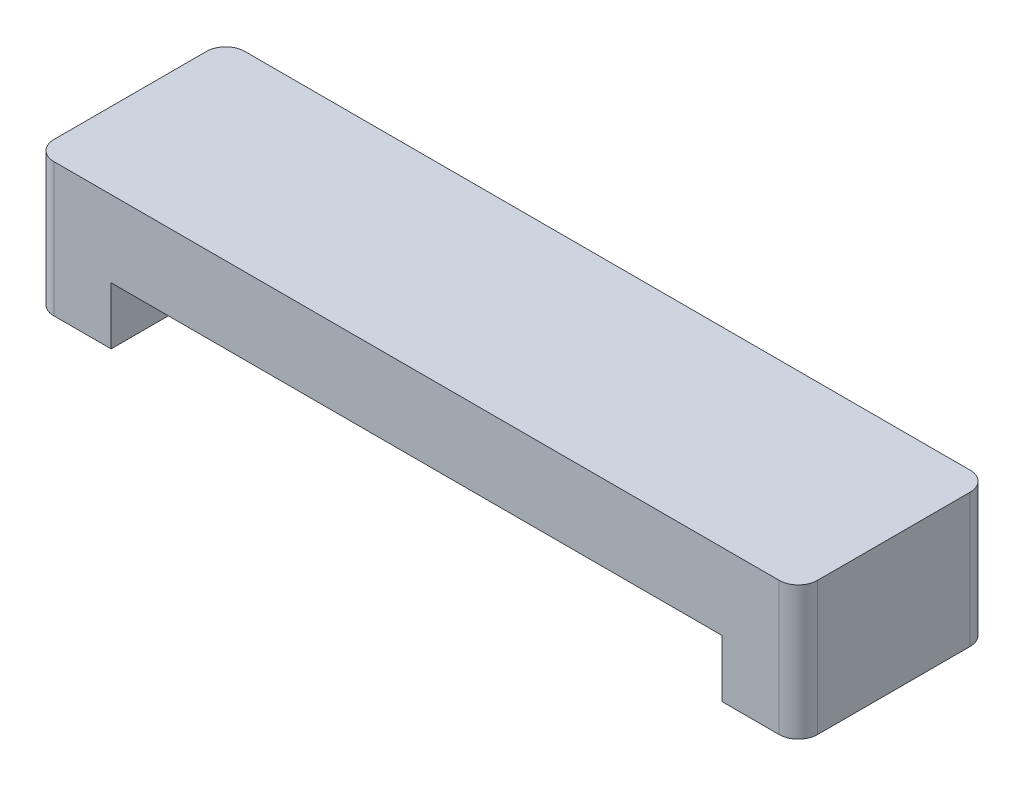
ISO-10303-21;
HEADER;
FILE_DESCRIPTION(('STEP AP214'),'2;1');
FILE_NAME('part.step','',(''),(''),'','','');
FILE_SCHEMA(('AUTOMOTIVE_DESIGN { 1 0 10303 214 1 1 1 1 }'));
ENDSEC;
DATA;
#1=APPLICATION_CONTEXT('core data for automotive mechanical design processes');
#2=APPLICATION_PROTOCOL_DEFINITION('international standard','automotive_design',2000,#1);
#3=PRODUCT_CONTEXT('',#1,'mechanical');
#4=PRODUCT('Part','Part','',(#3));
#5=PRODUCT_RELATED_PRODUCT_CATEGORY('part','',(#4));
#6=PRODUCT_DEFINITION_FORMATION('','',#4);
#7=PRODUCT_DEFINITION_CONTEXT('part definition',#1,'design');
#8=PRODUCT_DEFINITION('design','',#6,#7);
#9=PRODUCT_DEFINITION_SHAPE('','',#8);
#10=(LENGTH_UNIT() NAMED_UNIT(*) SI_UNIT(.MILLI.,.METRE.));
#11=(NAMED_UNIT(*) PLANE_ANGLE_UNIT() SI_UNIT($,.RADIAN.));
#12=(NAMED_UNIT(*) SI_UNIT($,.STERADIAN.) SOLID_ANGLE_UNIT());
#13=UNCERTAINTY_MEASURE_WITH_UNIT(LENGTH_MEASURE(1.E-05),#10,'distance_accuracy_value','');
#14=(GEOMETRIC_REPRESENTATION_CONTEXT(3) GLOBAL_UNCERTAINTY_ASSIGNED_CONTEXT((#13)) GLOBAL_UNIT_ASSIGNED_CONTEXT((#10,
#11,#12)) REPRESENTATION_CONTEXT('',''));
#15=CARTESIAN_POINT('',(0.,0.,0.));
#16=DIRECTION('',(0.,0.,1.));
#17=DIRECTION('',(1.,0.,0.));
#18=AXIS2_PLACEMENT_3D('',#15,#16,#17);
#19=CARTESIAN_POINT('',(-51.4442689731614,55.5056034200374,20.));
#20=DIRECTION('',(1.,0.,0.));
#21=DIRECTION('',(0.,0.,-1.));
#22=AXIS2_PLACEMENT_3D('',#19,#20,#21);
#23=PLANE('',#22);
#24=DIRECTION('',(0.,0.,-1.));
#25=VECTOR('',#24,1.);
#26=CARTESIAN_POINT('',(-51.4442689731614,55.5056034200374,20.));
#27=LINE('',#26,#25);
#28=CARTESIAN_POINT('',(-51.4442689731614,55.5056034200374,18.));
#29=VERTEX_POINT('',#28);
#30=CARTESIAN_POINT('',(-51.4442689731614,55.5056034200374,2.));
#31=VERTEX_POINT('',#30);
#32=EDGE_CURVE('E159',#29,#31,#27,.T.);
#33=ORIENTED_EDGE('',*,*,#32,.T.);
#34=DIRECTION('',(0.,-1.,0.));
#35=VECTOR('',#34,1.);
#36=CARTESIAN_POINT('',(-51.4442689731614,55.5056034200374,2.));
#37=LINE('',#36,#35);
#38=CARTESIAN_POINT('',(-51.4442689731614,41.5056034200374,2.));
#39=VERTEX_POINT('',#38);
#40=EDGE_CURVE('E11',#31,#39,#37,.T.);
#41=ORIENTED_EDGE('',*,*,#40,.T.);
#42=DIRECTION('',(0.,0.,-1.));
#43=VECTOR('',#42,1.);
#44=CARTESIAN_POINT('',(-51.4442689731614,41.5056034200374,20.));
#45=LINE('',#44,#43);
#46=CARTESIAN_POINT('',(-51.4442689731614,41.5056034200374,18.));
#47=VERTEX_POINT('',#46);
#48=EDGE_CURVE('E174',#47,#39,#45,.T.);
#49=ORIENTED_EDGE('',*,*,#48,.F.);
#50=DIRECTION('',(0.,-1.,0.));
#51=VECTOR('',#50,1.);
#52=CARTESIAN_POINT('',(-51.4442689731614,55.5056034200374,18.));
#53=LINE('',#52,#51);
#54=EDGE_CURVE('E41',#47,#29,#53,.F.);
#55=ORIENTED_EDGE('',*,*,#54,.T.);
#56=EDGE_LOOP('',(#33,#41,#49,#55));
#57=FACE_BOUND('',#56,.T.);
#58=ADVANCED_FACE('F33',(#57),#23,.F.);
#59=CARTESIAN_POINT('',(-51.4442689731614,41.5056034200374,20.));
#60=DIRECTION('',(0.,1.,0.));
#61=DIRECTION('',(0.,0.,1.));
#62=AXIS2_PLACEMENT_3D('',#59,#60,#61);
#63=PLANE('',#62);
#64=DIRECTION('',(1.,0.,0.));
#65=VECTOR('',#64,1.);
#66=CARTESIAN_POINT('',(-51.4442689731614,41.5056034200374,0.));
#67=LINE('',#66,#65);
#68=CARTESIAN_POINT('',(-49.4442689731614,41.5056034200374,0.));
#69=VERTEX_POINT('',#68);
#70=CARTESIAN_POINT('',(26.5557310268386,41.5056034200374,0.));
#71=VERTEX_POINT('',#70);
#72=EDGE_CURVE('E160',#69,#71,#67,.T.);
#73=ORIENTED_EDGE('',*,*,#72,.T.);
#74=CARTESIAN_POINT('',(26.5557310268386,41.5056034200374,2.));
#75=DIRECTION('',(0.,1.,0.));
#76=DIRECTION('',(0.,0.,1.));
#77=AXIS2_PLACEMENT_3D('',#74,#75,#76);
#78=CIRCLE('',#77,2.);
#79=CARTESIAN_POINT('',(28.5557310268386,41.5056034200374,2.));
#80=VERTEX_POINT('',#79);
#81=EDGE_CURVE('E198',#71,#80,#78,.F.);
#82=ORIENTED_EDGE('',*,*,#81,.T.);
#83=DIRECTION('',(0.,0.,-1.));
#84=VECTOR('',#83,1.);
#85=CARTESIAN_POINT('',(28.5557310268386,41.5056034200374,20.));
#86=LINE('',#85,#84);
#87=CARTESIAN_POINT('',(28.5557310268386,41.5056034200374,18.));
#88=VERTEX_POINT('',#87);
#89=EDGE_CURVE('E171',#88,#80,#86,.T.);
#90=ORIENTED_EDGE('',*,*,#89,.F.);
#91=CARTESIAN_POINT('',(26.5557310268386,41.5056034200374,18.));
#92=DIRECTION('',(0.,1.,0.));
#93=DIRECTION('',(0.,0.,1.));
#94=AXIS2_PLACEMENT_3D('',#91,#92,#93);
#95=CIRCLE('',#94,2.);
#96=CARTESIAN_POINT('',(26.5557310268386,41.5056034200374,20.));
#97=VERTEX_POINT('',#96);
#98=EDGE_CURVE('E48',#88,#97,#95,.F.);
#99=ORIENTED_EDGE('',*,*,#98,.T.);
#100=DIRECTION('',(1.,0.,0.));
#101=VECTOR('',#100,1.);
#102=CARTESIAN_POINT('',(-51.4442689731614,41.5056034200374,20.));
#103=LINE('',#102,#101);
#104=CARTESIAN_POINT('',(20.5557310268386,41.5056034200374,20.));
#105=VERTEX_POINT('',#104);
#106=EDGE_CURVE('E147',#105,#97,#103,.T.);
#107=ORIENTED_EDGE('',*,*,#106,.F.);
#108=DIRECTION('',(0.,0.,1.));
#109=VECTOR('',#108,1.);
#110=CARTESIAN_POINT('',(20.5557310268386,41.5056034200374,12.));
#111=LINE('',#110,#109);
#112=CARTESIAN_POINT('',(20.5557310268386,41.5056034200374,12.));
#113=VERTEX_POINT('',#112);
#114=EDGE_CURVE('E128',#113,#105,#111,.T.);
#115=ORIENTED_EDGE('',*,*,#114,.F.);
#116=DIRECTION('',(1.,0.,0.));
#117=VECTOR('',#116,1.);
#118=CARTESIAN_POINT('',(20.5557310268386,41.5056034200374,12.));
#119=LINE('',#118,#117);
#120=CARTESIAN_POINT('',(-43.4442689731614,41.5056034200374,12.));
#121=VERTEX_POINT('',#120);
#122=EDGE_CURVE('E135',#121,#113,#119,.T.);
#123=ORIENTED_EDGE('',*,*,#122,.F.);
#124=DIRECTION('',(0.,0.,1.));
#125=VECTOR('',#124,1.);
#126=CARTESIAN_POINT('',(-43.4442689731614,41.5056034200374,12.));
#127=LINE('',#126,#125);
#128=CARTESIAN_POINT('',(-43.4442689731614,41.5056034200374,20.));
#129=VERTEX_POINT('',#128);
#130=EDGE_CURVE('E163',#121,#129,#127,.T.);
#131=ORIENTED_EDGE('',*,*,#130,.T.);
#132=CARTESIAN_POINT('',(-49.4442689731614,41.5056034200374,20.));
#133=VERTEX_POINT('',#132);
#134=EDGE_CURVE('E154',#133,#129,#103,.T.);
#135=ORIENTED_EDGE('',*,*,#134,.F.);
#136=CARTESIAN_POINT('',(-49.4442689731614,41.5056034200374,18.));
#137=DIRECTION('',(0.,1.,0.));
#138=DIRECTION('',(0.,0.,1.));
#139=AXIS2_PLACEMENT_3D('',#136,#137,#138);
#140=CIRCLE('',#139,2.);
#141=EDGE_CURVE('E194',#133,#47,#140,.F.);
#142=ORIENTED_EDGE('',*,*,#141,.T.);
#143=ORIENTED_EDGE('',*,*,#48,.T.);
#144=CARTESIAN_POINT('',(-49.4442689731614,41.5056034200374,2.));
#145=DIRECTION('',(0.,1.,0.));
#146=DIRECTION('',(0.,0.,1.));
#147=AXIS2_PLACEMENT_3D('',#144,#145,#146);
#148=CIRCLE('',#147,2.);
#149=EDGE_CURVE('E56',#39,#69,#148,.F.);
#150=ORIENTED_EDGE('',*,*,#149,.T.);
#151=EDGE_LOOP('',(#73,#82,#90,#99,#107,#115,#123,#131,#135,#142,#143,#150));
#152=FACE_BOUND('',#151,.T.);
#153=ADVANCED_FACE('F146',(#152),#63,.F.);
#154=CARTESIAN_POINT('',(28.5557310268386,55.5056034200374,20.));
#155=DIRECTION('',(-1.,0.,0.));
#156=DIRECTION('',(0.,-1.,0.));
#157=AXIS2_PLACEMENT_3D('',#154,#155,#156);
#158=PLANE('',#157);
#159=ORIENTED_EDGE('',*,*,#89,.T.);
#160=DIRECTION('',(0.,1.,0.));
#161=VECTOR('',#160,1.);
#162=CARTESIAN_POINT('',(28.5557310268386,55.5056034200374,2.));
#163=LINE('',#162,#161);
#164=CARTESIAN_POINT('',(28.5557310268386,55.5056034200374,2.));
#165=VERTEX_POINT('',#164);
#166=EDGE_CURVE('E179',#80,#165,#163,.T.);
#167=ORIENTED_EDGE('',*,*,#166,.T.);
#168=DIRECTION('',(0.,0.,-1.));
#169=VECTOR('',#168,1.);
#170=CARTESIAN_POINT('',(28.5557310268386,55.5056034200374,20.));
#171=LINE('',#170,#169);
#172=CARTESIAN_POINT('',(28.5557310268386,55.5056034200374,18.));
#173=VERTEX_POINT('',#172);
#174=EDGE_CURVE('E168',#173,#165,#171,.T.);
#175=ORIENTED_EDGE('',*,*,#174,.F.);
#176=DIRECTION('',(0.,1.,0.));
#177=VECTOR('',#176,1.);
#178=CARTESIAN_POINT('',(28.5557310268386,41.5056034200374,18.));
#179=LINE('',#178,#177);
#180=EDGE_CURVE('E177',#173,#88,#179,.F.);
#181=ORIENTED_EDGE('',*,*,#180,.T.);
#182=EDGE_LOOP('',(#159,#167,#175,#181));
#183=FACE_BOUND('',#182,.T.);
#184=ADVANCED_FACE('F250',(#183),#158,.F.);
#185=CARTESIAN_POINT('',(-51.4442689731614,55.5056034200374,20.));
#186=DIRECTION('',(0.,-1.,0.));
#187=DIRECTION('',(0.,0.,-1.));
#188=AXIS2_PLACEMENT_3D('',#185,#186,#187);
#189=PLANE('',#188);
#190=ORIENTED_EDGE('',*,*,#174,.T.);
#191=CARTESIAN_POINT('',(26.5557310268386,55.5056034200374,2.));
#192=DIRECTION('',(0.,-1.,0.));
#193=DIRECTION('',(0.,0.,-1.));
#194=AXIS2_PLACEMENT_3D('',#191,#192,#193);
#195=CIRCLE('',#194,2.);
#196=CARTESIAN_POINT('',(26.5557310268386,55.5056034200374,0.));
#197=VERTEX_POINT('',#196);
#198=EDGE_CURVE('E188',#165,#197,#195,.F.);
#199=ORIENTED_EDGE('',*,*,#198,.T.);
#200=DIRECTION('',(-1.,0.,0.));
#201=VECTOR('',#200,1.);
#202=CARTESIAN_POINT('',(-51.4442689731614,55.5056034200374,0.));
#203=LINE('',#202,#201);
#204=CARTESIAN_POINT('',(-49.4442689731614,55.5056034200374,0.));
#205=VERTEX_POINT('',#204);
#206=EDGE_CURVE('E162',#197,#205,#203,.T.);
#207=ORIENTED_EDGE('',*,*,#206,.T.);
#208=CARTESIAN_POINT('',(-49.4442689731614,55.5056034200374,2.));
#209=DIRECTION('',(0.,-1.,0.));
#210=DIRECTION('',(0.,0.,-1.));
#211=AXIS2_PLACEMENT_3D('',#208,#209,#210);
#212=CIRCLE('',#211,2.);
#213=EDGE_CURVE('E184',#205,#31,#212,.F.);
#214=ORIENTED_EDGE('',*,*,#213,.T.);
#215=ORIENTED_EDGE('',*,*,#32,.F.);
#216=CARTESIAN_POINT('',(-49.4442689731614,55.5056034200374,18.));
#217=DIRECTION('',(0.,-1.,0.));
#218=DIRECTION('',(0.,0.,-1.));
#219=AXIS2_PLACEMENT_3D('',#216,#217,#218);
#220=CIRCLE('',#219,2.);
#221=CARTESIAN_POINT('',(-49.4442689731614,55.5056034200374,20.));
#222=VERTEX_POINT('',#221);
#223=EDGE_CURVE('E182',#29,#222,#220,.F.);
#224=ORIENTED_EDGE('',*,*,#223,.T.);
#225=DIRECTION('',(-1.,0.,0.));
#226=VECTOR('',#225,1.);
#227=CARTESIAN_POINT('',(-51.4442689731614,55.5056034200374,20.));
#228=LINE('',#227,#226);
#229=CARTESIAN_POINT('',(26.5557310268386,55.5056034200374,20.));
#230=VERTEX_POINT('',#229);
#231=EDGE_CURVE('E156',#230,#222,#228,.T.);
#232=ORIENTED_EDGE('',*,*,#231,.F.);
#233=CARTESIAN_POINT('',(26.5557310268386,55.5056034200374,18.));
#234=DIRECTION('',(0.,-1.,0.));
#235=DIRECTION('',(0.,0.,-1.));
#236=AXIS2_PLACEMENT_3D('',#233,#234,#235);
#237=CIRCLE('',#236,2.);
#238=EDGE_CURVE('E186',#230,#173,#237,.F.);
#239=ORIENTED_EDGE('',*,*,#238,.T.);
#240=EDGE_LOOP('',(#190,#199,#207,#214,#215,#224,#232,#239));
#241=FACE_BOUND('',#240,.T.);
#242=ADVANCED_FACE('F212',(#241),#189,.F.);
#243=CARTESIAN_POINT('',(0.,0.,20.));
#244=DIRECTION('',(0.,0.,1.));
#245=DIRECTION('',(1.,0.,0.));
#246=AXIS2_PLACEMENT_3D('',#243,#244,#245);
#247=PLANE('',#246);
#248=ORIENTED_EDGE('',*,*,#106,.T.);
#249=DIRECTION('',(0.,1.,0.));
#250=VECTOR('',#249,1.);
#251=CARTESIAN_POINT('',(26.5557310268386,55.5056034200374,20.));
#252=LINE('',#251,#250);
#253=EDGE_CURVE('E203',#97,#230,#252,.T.);
#254=ORIENTED_EDGE('',*,*,#253,.T.);
#255=ORIENTED_EDGE('',*,*,#231,.T.);
#256=DIRECTION('',(0.,-1.,0.));
#257=VECTOR('',#256,1.);
#258=CARTESIAN_POINT('',(-49.4442689731614,41.5056034200374,20.));
#259=LINE('',#258,#257);
#260=EDGE_CURVE('E200',#222,#133,#259,.T.);
#261=ORIENTED_EDGE('',*,*,#260,.T.);
#262=ORIENTED_EDGE('',*,*,#134,.T.);
#263=DIRECTION('',(0.,-1.,0.));
#264=VECTOR('',#263,1.);
#265=CARTESIAN_POINT('',(-43.4442689731614,41.5056034200374,20.));
#266=LINE('',#265,#264);
#267=CARTESIAN_POINT('',(-43.4442689731614,47.5056034200374,20.));
#268=VERTEX_POINT('',#267);
#269=EDGE_CURVE('E143',#268,#129,#266,.T.);
#270=ORIENTED_EDGE('',*,*,#269,.F.);
#271=DIRECTION('',(-1.,0.,0.));
#272=VECTOR('',#271,1.);
#273=CARTESIAN_POINT('',(-43.4442689731614,47.5056034200374,20.));
#274=LINE('',#273,#272);
#275=CARTESIAN_POINT('',(20.5557310268386,47.5056034200374,20.));
#276=VERTEX_POINT('',#275);
#277=EDGE_CURVE('E225',#276,#268,#274,.T.);
#278=ORIENTED_EDGE('',*,*,#277,.F.);
#279=DIRECTION('',(0.,1.,0.));
#280=VECTOR('',#279,1.);
#281=CARTESIAN_POINT('',(20.5557310268386,47.5056034200374,20.));
#282=LINE('',#281,#280);
#283=EDGE_CURVE('E228',#105,#276,#282,.T.);
#284=ORIENTED_EDGE('',*,*,#283,.F.);
#285=EDGE_LOOP('',(#248,#254,#255,#261,#262,#270,#278,#284));
#286=FACE_BOUND('',#285,.T.);
#287=ADVANCED_FACE('F218',(#286),#247,.T.);
#288=CARTESIAN_POINT('',(0.,0.,0.));
#289=DIRECTION('',(0.,0.,1.));
#290=DIRECTION('',(1.,0.,0.));
#291=AXIS2_PLACEMENT_3D('',#288,#289,#290);
#292=PLANE('',#291);
#293=ORIENTED_EDGE('',*,*,#206,.F.);
#294=DIRECTION('',(0.,1.,0.));
#295=VECTOR('',#294,1.);
#296=CARTESIAN_POINT('',(26.5557310268386,0.,0.));
#297=LINE('',#296,#295);
#298=EDGE_CURVE('E192',#197,#71,#297,.F.);
#299=ORIENTED_EDGE('',*,*,#298,.T.);
#300=ORIENTED_EDGE('',*,*,#72,.F.);
#301=DIRECTION('',(0.,-1.,0.));
#302=VECTOR('',#301,1.);
#303=CARTESIAN_POINT('',(-49.4442689731614,0.,0.));
#304=LINE('',#303,#302);
#305=EDGE_CURVE('E190',#69,#205,#304,.F.);
#306=ORIENTED_EDGE('',*,*,#305,.T.);
#307=EDGE_LOOP('',(#293,#299,#300,#306));
#308=FACE_BOUND('',#307,.T.);
#309=ADVANCED_FACE('F235',(#308),#292,.F.);
#310=CARTESIAN_POINT('',(-43.4442689731614,41.5056034200374,12.));
#311=DIRECTION('',(-1.,0.,0.));
#312=DIRECTION('',(0.,0.,1.));
#313=AXIS2_PLACEMENT_3D('',#310,#311,#312);
#314=PLANE('',#313);
#315=ORIENTED_EDGE('',*,*,#269,.T.);
#316=ORIENTED_EDGE('',*,*,#130,.F.);
#317=DIRECTION('',(0.,-1.,0.));
#318=VECTOR('',#317,1.);
#319=CARTESIAN_POINT('',(-43.4442689731614,41.5056034200374,12.));
#320=LINE('',#319,#318);
#321=CARTESIAN_POINT('',(-43.4442689731614,47.5056034200374,12.));
#322=VERTEX_POINT('',#321);
#323=EDGE_CURVE('E141',#322,#121,#320,.T.);
#324=ORIENTED_EDGE('',*,*,#323,.F.);
#325=DIRECTION('',(0.,0.,1.));
#326=VECTOR('',#325,1.);
#327=CARTESIAN_POINT('',(-43.4442689731614,47.5056034200374,12.));
#328=LINE('',#327,#326);
#329=EDGE_CURVE('E149',#322,#268,#328,.T.);
#330=ORIENTED_EDGE('',*,*,#329,.T.);
#331=EDGE_LOOP('',(#315,#316,#324,#330));
#332=FACE_BOUND('',#331,.T.);
#333=ADVANCED_FACE('F233',(#332),#314,.F.);
#334=CARTESIAN_POINT('',(-43.4442689731614,47.5056034200374,12.));
#335=DIRECTION('',(0.,1.,0.));
#336=DIRECTION('',(0.,0.,1.));
#337=AXIS2_PLACEMENT_3D('',#334,#335,#336);
#338=PLANE('',#337);
#339=ORIENTED_EDGE('',*,*,#277,.T.);
#340=ORIENTED_EDGE('',*,*,#329,.F.);
#341=DIRECTION('',(-1.,0.,0.));
#342=VECTOR('',#341,1.);
#343=CARTESIAN_POINT('',(-43.4442689731614,47.5056034200374,12.));
#344=LINE('',#343,#342);
#345=CARTESIAN_POINT('',(20.5557310268386,47.5056034200374,12.));
#346=VERTEX_POINT('',#345);
#347=EDGE_CURVE('E134',#346,#322,#344,.T.);
#348=ORIENTED_EDGE('',*,*,#347,.F.);
#349=DIRECTION('',(0.,0.,1.));
#350=VECTOR('',#349,1.);
#351=CARTESIAN_POINT('',(20.5557310268386,47.5056034200374,12.));
#352=LINE('',#351,#350);
#353=EDGE_CURVE('E130',#346,#276,#352,.T.);
#354=ORIENTED_EDGE('',*,*,#353,.T.);
#355=EDGE_LOOP('',(#339,#340,#348,#354));
#356=FACE_BOUND('',#355,.T.);
#357=ADVANCED_FACE('F231',(#356),#338,.F.);
#358=CARTESIAN_POINT('',(20.5557310268386,47.5056034200374,12.));
#359=DIRECTION('',(1.,0.,0.));
#360=DIRECTION('',(0.,1.,0.));
#361=AXIS2_PLACEMENT_3D('',#358,#359,#360);
#362=PLANE('',#361);
#363=ORIENTED_EDGE('',*,*,#283,.T.);
#364=ORIENTED_EDGE('',*,*,#353,.F.);
#365=DIRECTION('',(0.,1.,0.));
#366=VECTOR('',#365,1.);
#367=CARTESIAN_POINT('',(20.5557310268386,47.5056034200374,12.));
#368=LINE('',#367,#366);
#369=EDGE_CURVE('E123',#113,#346,#368,.T.);
#370=ORIENTED_EDGE('',*,*,#369,.F.);
#371=ORIENTED_EDGE('',*,*,#114,.T.);
#372=EDGE_LOOP('',(#363,#364,#370,#371));
#373=FACE_BOUND('',#372,.T.);
#374=ADVANCED_FACE('F126',(#373),#362,.F.);
#375=CARTESIAN_POINT('',(0.,0.,12.));
#376=DIRECTION('',(0.,0.,-1.));
#377=DIRECTION('',(-1.,0.,0.));
#378=AXIS2_PLACEMENT_3D('',#375,#376,#377);
#379=PLANE('',#378);
#380=ORIENTED_EDGE('',*,*,#122,.T.);
#381=ORIENTED_EDGE('',*,*,#369,.T.);
#382=ORIENTED_EDGE('',*,*,#347,.T.);
#383=ORIENTED_EDGE('',*,*,#323,.T.);
#384=EDGE_LOOP('',(#380,#381,#382,#383));
#385=FACE_BOUND('',#384,.T.);
#386=ADVANCED_FACE('F139',(#385),#379,.F.);
#387=CARTESIAN_POINT('',(26.5557310268386,55.5056034200374,2.));
#388=DIRECTION('',(0.,1.,0.));
#389=DIRECTION('',(-1.,0.,0.));
#390=AXIS2_PLACEMENT_3D('',#387,#388,#389);
#391=CYLINDRICAL_SURFACE('',#390,2.);
#392=ORIENTED_EDGE('',*,*,#81,.F.);
#393=ORIENTED_EDGE('',*,*,#298,.F.);
#394=ORIENTED_EDGE('',*,*,#198,.F.);
#395=ORIENTED_EDGE('',*,*,#166,.F.);
#396=EDGE_LOOP('',(#392,#393,#394,#395));
#397=FACE_BOUND('',#396,.T.);
#398=ADVANCED_FACE('F254',(#397),#391,.T.);
#399=CARTESIAN_POINT('',(26.5557310268386,0.,18.));
#400=DIRECTION('',(0.,-1.,0.));
#401=DIRECTION('',(1.,0.,0.));
#402=AXIS2_PLACEMENT_3D('',#399,#400,#401);
#403=CYLINDRICAL_SURFACE('',#402,2.);
#404=ORIENTED_EDGE('',*,*,#98,.F.);
#405=ORIENTED_EDGE('',*,*,#180,.F.);
#406=ORIENTED_EDGE('',*,*,#238,.F.);
#407=ORIENTED_EDGE('',*,*,#253,.F.);
#408=EDGE_LOOP('',(#404,#405,#406,#407));
#409=FACE_BOUND('',#408,.T.);
#410=ADVANCED_FACE('F257',(#409),#403,.T.);
#411=CARTESIAN_POINT('',(-49.4442689731614,55.5056034200374,2.));
#412=DIRECTION('',(0.,-1.,0.));
#413=DIRECTION('',(0.,0.,-1.));
#414=AXIS2_PLACEMENT_3D('',#411,#412,#413);
#415=CYLINDRICAL_SURFACE('',#414,2.);
#416=ORIENTED_EDGE('',*,*,#213,.F.);
#417=ORIENTED_EDGE('',*,*,#305,.F.);
#418=ORIENTED_EDGE('',*,*,#149,.F.);
#419=ORIENTED_EDGE('',*,*,#40,.F.);
#420=EDGE_LOOP('',(#416,#417,#418,#419));
#421=FACE_BOUND('',#420,.T.);
#422=ADVANCED_FACE('F260',(#421),#415,.T.);
#423=CARTESIAN_POINT('',(-49.4442689731614,0.,18.));
#424=DIRECTION('',(0.,1.,0.));
#425=DIRECTION('',(0.,0.,1.));
#426=AXIS2_PLACEMENT_3D('',#423,#424,#425);
#427=CYLINDRICAL_SURFACE('',#426,2.);
#428=ORIENTED_EDGE('',*,*,#223,.F.);
#429=ORIENTED_EDGE('',*,*,#54,.F.);
#430=ORIENTED_EDGE('',*,*,#141,.F.);
#431=ORIENTED_EDGE('',*,*,#260,.F.);
#432=EDGE_LOOP('',(#428,#429,#430,#431));
#433=FACE_BOUND('',#432,.T.);
#434=ADVANCED_FACE('F35',(#433),#427,.T.);
#435=CLOSED_SHELL('',(#58,#153,#184,#242,#287,#309,#333,#357,#374,#386,#398,#410,#422,#434));
#436=MANIFOLD_SOLID_BREP('B2',#435);
#437=ADVANCED_BREP_SHAPE_REPRESENTATION('',(#18,#436),#14);
#438=SHAPE_DEFINITION_REPRESENTATION(#9,#437);
ENDSEC;
END-ISO-10303-21;
